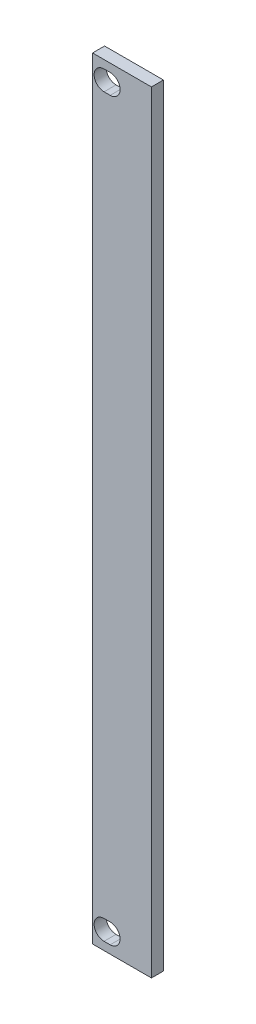
ISO-10303-21;
HEADER;
FILE_DESCRIPTION(('STEP AP214'),'2;1');
FILE_NAME('part.step','',(''),(''),'','','');
FILE_SCHEMA(('AUTOMOTIVE_DESIGN { 1 0 10303 214 1 1 1 1 }'));
ENDSEC;
DATA;
#1=APPLICATION_CONTEXT('core data for automotive mechanical design processes');
#2=APPLICATION_PROTOCOL_DEFINITION('international standard','automotive_design',2000,#1);
#3=PRODUCT_CONTEXT('',#1,'mechanical');
#4=PRODUCT('Part','Part','',(#3));
#5=PRODUCT_RELATED_PRODUCT_CATEGORY('part','',(#4));
#6=PRODUCT_DEFINITION_FORMATION('','',#4);
#7=PRODUCT_DEFINITION_CONTEXT('part definition',#1,'design');
#8=PRODUCT_DEFINITION('design','',#6,#7);
#9=PRODUCT_DEFINITION_SHAPE('','',#8);
#10=(LENGTH_UNIT() NAMED_UNIT(*) SI_UNIT(.MILLI.,.METRE.));
#11=(NAMED_UNIT(*) PLANE_ANGLE_UNIT() SI_UNIT($,.RADIAN.));
#12=(NAMED_UNIT(*) SI_UNIT($,.STERADIAN.) SOLID_ANGLE_UNIT());
#13=UNCERTAINTY_MEASURE_WITH_UNIT(LENGTH_MEASURE(1.E-05),#10,'distance_accuracy_value','');
#14=(GEOMETRIC_REPRESENTATION_CONTEXT(3) GLOBAL_UNCERTAINTY_ASSIGNED_CONTEXT((#13)) GLOBAL_UNIT_ASSIGNED_CONTEXT((#10,
#11,#12)) REPRESENTATION_CONTEXT('',''));
#15=CARTESIAN_POINT('',(0.,0.,0.));
#16=DIRECTION('',(0.,0.,1.));
#17=DIRECTION('',(1.,0.,0.));
#18=AXIS2_PLACEMENT_3D('',#15,#16,#17);
#19=CARTESIAN_POINT('',(0.,0.,2.));
#20=DIRECTION('',(0.,0.,1.));
#21=DIRECTION('',(1.,0.,0.));
#22=AXIS2_PLACEMENT_3D('',#19,#20,#21);
#23=PLANE('',#22);
#24=DIRECTION('',(0.,1.,0.));
#25=VECTOR('',#24,1.);
#26=CARTESIAN_POINT('',(4.9,64.25,2.));
#27=LINE('',#26,#25);
#28=CARTESIAN_POINT('',(4.90000000000001,-64.25,2.));
#29=VERTEX_POINT('',#28);
#30=CARTESIAN_POINT('',(4.9,64.25,2.));
#31=VERTEX_POINT('',#30);
#32=EDGE_CURVE('E238',#29,#31,#27,.T.);
#33=ORIENTED_EDGE('',*,*,#32,.T.);
#34=DIRECTION('',(-1.,0.,0.));
#35=VECTOR('',#34,1.);
#36=CARTESIAN_POINT('',(-4.9,64.25,2.));
#37=LINE('',#36,#35);
#38=CARTESIAN_POINT('',(-4.9,64.25,2.));
#39=VERTEX_POINT('',#38);
#40=EDGE_CURVE('E243',#31,#39,#37,.T.);
#41=ORIENTED_EDGE('',*,*,#40,.T.);
#42=DIRECTION('',(0.,-1.,0.));
#43=VECTOR('',#42,1.);
#44=CARTESIAN_POINT('',(-4.9,64.25,2.));
#45=LINE('',#44,#43);
#46=CARTESIAN_POINT('',(-4.89999999999999,-64.25,2.));
#47=VERTEX_POINT('',#46);
#48=EDGE_CURVE('E251',#39,#47,#45,.T.);
#49=ORIENTED_EDGE('',*,*,#48,.T.);
#50=DIRECTION('',(1.,0.,0.));
#51=VECTOR('',#50,1.);
#52=CARTESIAN_POINT('',(-4.89999999999999,-64.25,2.));
#53=LINE('',#52,#51);
#54=EDGE_CURVE('E254',#47,#29,#53,.T.);
#55=ORIENTED_EDGE('',*,*,#54,.T.);
#56=EDGE_LOOP('',(#33,#41,#49,#55));
#57=FACE_BOUND('',#56,.T.);
#58=DIRECTION('',(1.,0.,0.));
#59=VECTOR('',#58,1.);
#60=CARTESIAN_POINT('',(-2.98799999999998,-62.9,2.));
#61=LINE('',#60,#59);
#62=CARTESIAN_POINT('',(-2.98799999999998,-62.9,2.));
#63=VERTEX_POINT('',#62);
#64=CARTESIAN_POINT('',(-1.97200000000001,-62.9,2.));
#65=VERTEX_POINT('',#64);
#66=EDGE_CURVE('E196',#63,#65,#61,.T.);
#67=ORIENTED_EDGE('',*,*,#66,.F.);
#68=CARTESIAN_POINT('',(-2.98799999999998,-61.25,2.));
#69=DIRECTION('',(0.,0.,1.));
#70=DIRECTION('',(1.,0.,0.));
#71=AXIS2_PLACEMENT_3D('',#68,#69,#70);
#72=CIRCLE('',#71,1.65);
#73=CARTESIAN_POINT('',(-2.98799999999998,-59.6,2.));
#74=VERTEX_POINT('',#73);
#75=EDGE_CURVE('E192',#74,#63,#72,.T.);
#76=ORIENTED_EDGE('',*,*,#75,.F.);
#77=DIRECTION('',(-1.,0.,0.));
#78=VECTOR('',#77,1.);
#79=CARTESIAN_POINT('',(-2.98799999999998,-59.6,2.));
#80=LINE('',#79,#78);
#81=CARTESIAN_POINT('',(-1.97200000000001,-59.6,2.));
#82=VERTEX_POINT('',#81);
#83=EDGE_CURVE('E203',#82,#74,#80,.T.);
#84=ORIENTED_EDGE('',*,*,#83,.F.);
#85=CARTESIAN_POINT('',(-1.97200000000001,-61.25,2.));
#86=DIRECTION('',(0.,0.,1.));
#87=DIRECTION('',(1.,0.,0.));
#88=AXIS2_PLACEMENT_3D('',#85,#86,#87);
#89=CIRCLE('',#88,1.65);
#90=EDGE_CURVE('E208',#65,#82,#89,.T.);
#91=ORIENTED_EDGE('',*,*,#90,.F.);
#92=EDGE_LOOP('',(#67,#76,#84,#91));
#93=FACE_BOUND('',#92,.T.);
#94=DIRECTION('',(1.,0.,0.));
#95=VECTOR('',#94,1.);
#96=CARTESIAN_POINT('',(-2.98800000000001,59.6,2.));
#97=LINE('',#96,#95);
#98=CARTESIAN_POINT('',(-2.98800000000001,59.6,2.));
#99=VERTEX_POINT('',#98);
#100=CARTESIAN_POINT('',(-1.97200000000001,59.6,2.));
#101=VERTEX_POINT('',#100);
#102=EDGE_CURVE('E145',#99,#101,#97,.T.);
#103=ORIENTED_EDGE('',*,*,#102,.F.);
#104=CARTESIAN_POINT('',(-2.98800000000001,61.25,2.));
#105=DIRECTION('',(0.,0.,1.));
#106=DIRECTION('',(1.,0.,0.));
#107=AXIS2_PLACEMENT_3D('',#104,#105,#106);
#108=CIRCLE('',#107,1.65000000000001);
#109=CARTESIAN_POINT('',(-2.98800000000001,62.9,2.));
#110=VERTEX_POINT('',#109);
#111=EDGE_CURVE('E136',#110,#99,#108,.T.);
#112=ORIENTED_EDGE('',*,*,#111,.F.);
#113=DIRECTION('',(-1.,0.,0.));
#114=VECTOR('',#113,1.);
#115=CARTESIAN_POINT('',(-2.98800000000001,62.9,2.));
#116=LINE('',#115,#114);
#117=CARTESIAN_POINT('',(-1.97200000000001,62.9,2.));
#118=VERTEX_POINT('',#117);
#119=EDGE_CURVE('E162',#118,#110,#116,.T.);
#120=ORIENTED_EDGE('',*,*,#119,.F.);
#121=CARTESIAN_POINT('',(-1.97200000000001,61.25,2.));
#122=DIRECTION('',(0.,0.,1.));
#123=DIRECTION('',(1.,0.,0.));
#124=AXIS2_PLACEMENT_3D('',#121,#122,#123);
#125=CIRCLE('',#124,1.65000000000001);
#126=EDGE_CURVE('E158',#101,#118,#125,.T.);
#127=ORIENTED_EDGE('',*,*,#126,.F.);
#128=EDGE_LOOP('',(#103,#112,#120,#127));
#129=FACE_BOUND('',#128,.T.);
#130=ADVANCED_FACE('F46',(#57,#93,#129),#23,.T.);
#131=CARTESIAN_POINT('',(0.,0.,0.));
#132=DIRECTION('',(0.,0.,1.));
#133=DIRECTION('',(1.,0.,0.));
#134=AXIS2_PLACEMENT_3D('',#131,#132,#133);
#135=PLANE('',#134);
#136=CARTESIAN_POINT('',(-2.98799999999998,-61.25,0.));
#137=DIRECTION('',(0.,0.,1.));
#138=DIRECTION('',(1.,0.,0.));
#139=AXIS2_PLACEMENT_3D('',#136,#137,#138);
#140=CIRCLE('',#139,1.65);
#141=CARTESIAN_POINT('',(-2.98799999999998,-59.6,0.));
#142=VERTEX_POINT('',#141);
#143=CARTESIAN_POINT('',(-2.98799999999998,-62.9,0.));
#144=VERTEX_POINT('',#143);
#145=EDGE_CURVE('E154',#142,#144,#140,.T.);
#146=ORIENTED_EDGE('',*,*,#145,.T.);
#147=DIRECTION('',(1.,0.,0.));
#148=VECTOR('',#147,1.);
#149=CARTESIAN_POINT('',(-2.98799999999998,-62.9,0.));
#150=LINE('',#149,#148);
#151=CARTESIAN_POINT('',(-1.97200000000001,-62.9,0.));
#152=VERTEX_POINT('',#151);
#153=EDGE_CURVE('E213',#144,#152,#150,.T.);
#154=ORIENTED_EDGE('',*,*,#153,.T.);
#155=CARTESIAN_POINT('',(-1.97200000000001,-61.25,0.));
#156=DIRECTION('',(0.,0.,1.));
#157=DIRECTION('',(1.,0.,0.));
#158=AXIS2_PLACEMENT_3D('',#155,#156,#157);
#159=CIRCLE('',#158,1.65);
#160=CARTESIAN_POINT('',(-1.97200000000001,-59.6,0.));
#161=VERTEX_POINT('',#160);
#162=EDGE_CURVE('E217',#152,#161,#159,.T.);
#163=ORIENTED_EDGE('',*,*,#162,.T.);
#164=DIRECTION('',(-1.,0.,0.));
#165=VECTOR('',#164,1.);
#166=CARTESIAN_POINT('',(-2.98799999999998,-59.6,0.));
#167=LINE('',#166,#165);
#168=EDGE_CURVE('E197',#161,#142,#167,.T.);
#169=ORIENTED_EDGE('',*,*,#168,.T.);
#170=EDGE_LOOP('',(#146,#154,#163,#169));
#171=FACE_BOUND('',#170,.T.);
#172=DIRECTION('',(0.,1.,0.));
#173=VECTOR('',#172,1.);
#174=CARTESIAN_POINT('',(4.9,64.25,0.));
#175=LINE('',#174,#173);
#176=CARTESIAN_POINT('',(4.90000000000001,-64.25,0.));
#177=VERTEX_POINT('',#176);
#178=CARTESIAN_POINT('',(4.9,64.25,0.));
#179=VERTEX_POINT('',#178);
#180=EDGE_CURVE('E237',#177,#179,#175,.T.);
#181=ORIENTED_EDGE('',*,*,#180,.F.);
#182=DIRECTION('',(1.,0.,0.));
#183=VECTOR('',#182,1.);
#184=CARTESIAN_POINT('',(-4.89999999999999,-64.25,0.));
#185=LINE('',#184,#183);
#186=CARTESIAN_POINT('',(-4.89999999999999,-64.25,0.));
#187=VERTEX_POINT('',#186);
#188=EDGE_CURVE('E244',#187,#177,#185,.T.);
#189=ORIENTED_EDGE('',*,*,#188,.F.);
#190=DIRECTION('',(0.,-1.,0.));
#191=VECTOR('',#190,1.);
#192=CARTESIAN_POINT('',(-4.9,64.25,0.));
#193=LINE('',#192,#191);
#194=CARTESIAN_POINT('',(-4.9,64.25,0.));
#195=VERTEX_POINT('',#194);
#196=EDGE_CURVE('E265',#195,#187,#193,.T.);
#197=ORIENTED_EDGE('',*,*,#196,.F.);
#198=DIRECTION('',(-1.,0.,0.));
#199=VECTOR('',#198,1.);
#200=CARTESIAN_POINT('',(-4.9,64.25,0.));
#201=LINE('',#200,#199);
#202=EDGE_CURVE('E262',#179,#195,#201,.T.);
#203=ORIENTED_EDGE('',*,*,#202,.F.);
#204=EDGE_LOOP('',(#181,#189,#197,#203));
#205=FACE_BOUND('',#204,.T.);
#206=CARTESIAN_POINT('',(-2.98800000000001,61.25,0.));
#207=DIRECTION('',(0.,0.,1.));
#208=DIRECTION('',(1.,0.,0.));
#209=AXIS2_PLACEMENT_3D('',#206,#207,#208);
#210=CIRCLE('',#209,1.65000000000001);
#211=CARTESIAN_POINT('',(-2.98800000000001,62.9,0.));
#212=VERTEX_POINT('',#211);
#213=CARTESIAN_POINT('',(-2.98800000000001,59.6,0.));
#214=VERTEX_POINT('',#213);
#215=EDGE_CURVE('E70',#212,#214,#210,.T.);
#216=ORIENTED_EDGE('',*,*,#215,.T.);
#217=DIRECTION('',(1.,0.,0.));
#218=VECTOR('',#217,1.);
#219=CARTESIAN_POINT('',(-2.98800000000001,59.6,0.));
#220=LINE('',#219,#218);
#221=CARTESIAN_POINT('',(-1.97200000000001,59.6,0.));
#222=VERTEX_POINT('',#221);
#223=EDGE_CURVE('E152',#214,#222,#220,.T.);
#224=ORIENTED_EDGE('',*,*,#223,.T.);
#225=CARTESIAN_POINT('',(-1.97200000000001,61.25,0.));
#226=DIRECTION('',(0.,0.,1.));
#227=DIRECTION('',(1.,0.,0.));
#228=AXIS2_PLACEMENT_3D('',#225,#226,#227);
#229=CIRCLE('',#228,1.65000000000001);
#230=CARTESIAN_POINT('',(-1.97200000000001,62.9,0.));
#231=VERTEX_POINT('',#230);
#232=EDGE_CURVE('E179',#222,#231,#229,.T.);
#233=ORIENTED_EDGE('',*,*,#232,.T.);
#234=DIRECTION('',(-1.,0.,0.));
#235=VECTOR('',#234,1.);
#236=CARTESIAN_POINT('',(-2.98800000000001,62.9,0.));
#237=LINE('',#236,#235);
#238=EDGE_CURVE('E146',#231,#212,#237,.T.);
#239=ORIENTED_EDGE('',*,*,#238,.T.);
#240=EDGE_LOOP('',(#216,#224,#233,#239));
#241=FACE_BOUND('',#240,.T.);
#242=ADVANCED_FACE('F288',(#171,#205,#241),#135,.F.);
#243=CARTESIAN_POINT('',(4.9,64.25,2.));
#244=DIRECTION('',(-1.,0.,0.));
#245=DIRECTION('',(0.,-1.,0.));
#246=AXIS2_PLACEMENT_3D('',#243,#244,#245);
#247=PLANE('',#246);
#248=ORIENTED_EDGE('',*,*,#180,.T.);
#249=DIRECTION('',(0.,0.,-1.));
#250=VECTOR('',#249,1.);
#251=CARTESIAN_POINT('',(4.9,64.25,2.));
#252=LINE('',#251,#250);
#253=EDGE_CURVE('E12',#31,#179,#252,.T.);
#254=ORIENTED_EDGE('',*,*,#253,.F.);
#255=ORIENTED_EDGE('',*,*,#32,.F.);
#256=DIRECTION('',(0.,0.,-1.));
#257=VECTOR('',#256,1.);
#258=CARTESIAN_POINT('',(4.90000000000001,-64.25,2.));
#259=LINE('',#258,#257);
#260=EDGE_CURVE('E258',#29,#177,#259,.T.);
#261=ORIENTED_EDGE('',*,*,#260,.T.);
#262=EDGE_LOOP('',(#248,#254,#255,#261));
#263=FACE_BOUND('',#262,.T.);
#264=ADVANCED_FACE('F48',(#263),#247,.F.);
#265=CARTESIAN_POINT('',(-4.9,64.25,2.));
#266=DIRECTION('',(0.,-1.,0.));
#267=DIRECTION('',(0.,0.,-1.));
#268=AXIS2_PLACEMENT_3D('',#265,#266,#267);
#269=PLANE('',#268);
#270=ORIENTED_EDGE('',*,*,#202,.T.);
#271=DIRECTION('',(0.,0.,-1.));
#272=VECTOR('',#271,1.);
#273=CARTESIAN_POINT('',(-4.9,64.25,2.));
#274=LINE('',#273,#272);
#275=EDGE_CURVE('E55',#39,#195,#274,.T.);
#276=ORIENTED_EDGE('',*,*,#275,.F.);
#277=ORIENTED_EDGE('',*,*,#40,.F.);
#278=ORIENTED_EDGE('',*,*,#253,.T.);
#279=EDGE_LOOP('',(#270,#276,#277,#278));
#280=FACE_BOUND('',#279,.T.);
#281=ADVANCED_FACE('F327',(#280),#269,.F.);
#282=CARTESIAN_POINT('',(-4.9,64.25,2.));
#283=DIRECTION('',(1.,0.,0.));
#284=DIRECTION('',(0.,1.,0.));
#285=AXIS2_PLACEMENT_3D('',#282,#283,#284);
#286=PLANE('',#285);
#287=ORIENTED_EDGE('',*,*,#196,.T.);
#288=DIRECTION('',(0.,0.,-1.));
#289=VECTOR('',#288,1.);
#290=CARTESIAN_POINT('',(-4.89999999999999,-64.25,2.));
#291=LINE('',#290,#289);
#292=EDGE_CURVE('E273',#47,#187,#291,.T.);
#293=ORIENTED_EDGE('',*,*,#292,.F.);
#294=ORIENTED_EDGE('',*,*,#48,.F.);
#295=ORIENTED_EDGE('',*,*,#275,.T.);
#296=EDGE_LOOP('',(#287,#293,#294,#295));
#297=FACE_BOUND('',#296,.T.);
#298=ADVANCED_FACE('F282',(#297),#286,.F.);
#299=CARTESIAN_POINT('',(-4.89999999999999,-64.25,2.));
#300=DIRECTION('',(0.,1.,0.));
#301=DIRECTION('',(0.,0.,1.));
#302=AXIS2_PLACEMENT_3D('',#299,#300,#301);
#303=PLANE('',#302);
#304=ORIENTED_EDGE('',*,*,#188,.T.);
#305=ORIENTED_EDGE('',*,*,#260,.F.);
#306=ORIENTED_EDGE('',*,*,#54,.F.);
#307=ORIENTED_EDGE('',*,*,#292,.T.);
#308=EDGE_LOOP('',(#304,#305,#306,#307));
#309=FACE_BOUND('',#308,.T.);
#310=ADVANCED_FACE('F292',(#309),#303,.F.);
#311=CARTESIAN_POINT('',(-2.98799999999998,-61.25,2.));
#312=DIRECTION('',(0.,0.,-1.));
#313=DIRECTION('',(-1.,0.,0.));
#314=AXIS2_PLACEMENT_3D('',#311,#312,#313);
#315=CYLINDRICAL_SURFACE('',#314,1.65);
#316=ORIENTED_EDGE('',*,*,#145,.F.);
#317=DIRECTION('',(0.,0.,-1.));
#318=VECTOR('',#317,1.);
#319=CARTESIAN_POINT('',(-2.98799999999998,-59.6,2.));
#320=LINE('',#319,#318);
#321=EDGE_CURVE('E207',#74,#142,#320,.T.);
#322=ORIENTED_EDGE('',*,*,#321,.F.);
#323=ORIENTED_EDGE('',*,*,#75,.T.);
#324=DIRECTION('',(0.,0.,-1.));
#325=VECTOR('',#324,1.);
#326=CARTESIAN_POINT('',(-2.98799999999998,-62.9,2.));
#327=LINE('',#326,#325);
#328=EDGE_CURVE('E233',#63,#144,#327,.T.);
#329=ORIENTED_EDGE('',*,*,#328,.T.);
#330=EDGE_LOOP('',(#316,#322,#323,#329));
#331=FACE_BOUND('',#330,.T.);
#332=ADVANCED_FACE('F319',(#331),#315,.F.);
#333=CARTESIAN_POINT('',(-2.98799999999998,-62.9,2.));
#334=DIRECTION('',(0.,1.,0.));
#335=DIRECTION('',(0.,0.,1.));
#336=AXIS2_PLACEMENT_3D('',#333,#334,#335);
#337=PLANE('',#336);
#338=ORIENTED_EDGE('',*,*,#153,.F.);
#339=ORIENTED_EDGE('',*,*,#328,.F.);
#340=ORIENTED_EDGE('',*,*,#66,.T.);
#341=DIRECTION('',(0.,0.,-1.));
#342=VECTOR('',#341,1.);
#343=CARTESIAN_POINT('',(-1.97200000000001,-62.9,2.));
#344=LINE('',#343,#342);
#345=EDGE_CURVE('E230',#65,#152,#344,.T.);
#346=ORIENTED_EDGE('',*,*,#345,.T.);
#347=EDGE_LOOP('',(#338,#339,#340,#346));
#348=FACE_BOUND('',#347,.T.);
#349=ADVANCED_FACE('F307',(#348),#337,.T.);
#350=CARTESIAN_POINT('',(-1.97200000000001,-61.25,2.));
#351=DIRECTION('',(0.,0.,-1.));
#352=DIRECTION('',(-1.,0.,0.));
#353=AXIS2_PLACEMENT_3D('',#350,#351,#352);
#354=CYLINDRICAL_SURFACE('',#353,1.65);
#355=ORIENTED_EDGE('',*,*,#162,.F.);
#356=ORIENTED_EDGE('',*,*,#345,.F.);
#357=ORIENTED_EDGE('',*,*,#90,.T.);
#358=DIRECTION('',(0.,0.,-1.));
#359=VECTOR('',#358,1.);
#360=CARTESIAN_POINT('',(-1.97200000000001,-59.6,2.));
#361=LINE('',#360,#359);
#362=EDGE_CURVE('E227',#82,#161,#361,.T.);
#363=ORIENTED_EDGE('',*,*,#362,.T.);
#364=EDGE_LOOP('',(#355,#356,#357,#363));
#365=FACE_BOUND('',#364,.T.);
#366=ADVANCED_FACE('F312',(#365),#354,.F.);
#367=CARTESIAN_POINT('',(-2.98799999999998,-59.6,2.));
#368=DIRECTION('',(0.,-1.,0.));
#369=DIRECTION('',(0.,0.,-1.));
#370=AXIS2_PLACEMENT_3D('',#367,#368,#369);
#371=PLANE('',#370);
#372=ORIENTED_EDGE('',*,*,#168,.F.);
#373=ORIENTED_EDGE('',*,*,#362,.F.);
#374=ORIENTED_EDGE('',*,*,#83,.T.);
#375=ORIENTED_EDGE('',*,*,#321,.T.);
#376=EDGE_LOOP('',(#372,#373,#374,#375));
#377=FACE_BOUND('',#376,.T.);
#378=ADVANCED_FACE('F317',(#377),#371,.T.);
#379=CARTESIAN_POINT('',(-2.98800000000001,61.25,2.));
#380=DIRECTION('',(0.,0.,-1.));
#381=DIRECTION('',(-1.,0.,0.));
#382=AXIS2_PLACEMENT_3D('',#379,#380,#381);
#383=CYLINDRICAL_SURFACE('',#382,1.65000000000001);
#384=ORIENTED_EDGE('',*,*,#215,.F.);
#385=DIRECTION('',(0.,0.,-1.));
#386=VECTOR('',#385,1.);
#387=CARTESIAN_POINT('',(-2.98800000000001,62.9,2.));
#388=LINE('',#387,#386);
#389=EDGE_CURVE('E140',#110,#212,#388,.T.);
#390=ORIENTED_EDGE('',*,*,#389,.F.);
#391=ORIENTED_EDGE('',*,*,#111,.T.);
#392=DIRECTION('',(0.,0.,-1.));
#393=VECTOR('',#392,1.);
#394=CARTESIAN_POINT('',(-2.98800000000001,59.6,2.));
#395=LINE('',#394,#393);
#396=EDGE_CURVE('E139',#99,#214,#395,.T.);
#397=ORIENTED_EDGE('',*,*,#396,.T.);
#398=EDGE_LOOP('',(#384,#390,#391,#397));
#399=FACE_BOUND('',#398,.T.);
#400=ADVANCED_FACE('F138',(#399),#383,.F.);
#401=CARTESIAN_POINT('',(-2.98800000000001,59.6,2.));
#402=DIRECTION('',(0.,1.,0.));
#403=DIRECTION('',(0.,0.,1.));
#404=AXIS2_PLACEMENT_3D('',#401,#402,#403);
#405=PLANE('',#404);
#406=ORIENTED_EDGE('',*,*,#223,.F.);
#407=ORIENTED_EDGE('',*,*,#396,.F.);
#408=ORIENTED_EDGE('',*,*,#102,.T.);
#409=DIRECTION('',(0.,0.,-1.));
#410=VECTOR('',#409,1.);
#411=CARTESIAN_POINT('',(-1.97200000000001,59.6,2.));
#412=LINE('',#411,#410);
#413=EDGE_CURVE('E155',#101,#222,#412,.T.);
#414=ORIENTED_EDGE('',*,*,#413,.T.);
#415=EDGE_LOOP('',(#406,#407,#408,#414));
#416=FACE_BOUND('',#415,.T.);
#417=ADVANCED_FACE('F149',(#416),#405,.T.);
#418=CARTESIAN_POINT('',(-1.97200000000001,61.25,2.));
#419=DIRECTION('',(0.,0.,-1.));
#420=DIRECTION('',(-1.,0.,0.));
#421=AXIS2_PLACEMENT_3D('',#418,#419,#420);
#422=CYLINDRICAL_SURFACE('',#421,1.65000000000001);
#423=ORIENTED_EDGE('',*,*,#232,.F.);
#424=ORIENTED_EDGE('',*,*,#413,.F.);
#425=ORIENTED_EDGE('',*,*,#126,.T.);
#426=DIRECTION('',(0.,0.,-1.));
#427=VECTOR('',#426,1.);
#428=CARTESIAN_POINT('',(-1.97200000000001,62.9,2.));
#429=LINE('',#428,#427);
#430=EDGE_CURVE('E62',#118,#231,#429,.T.);
#431=ORIENTED_EDGE('',*,*,#430,.T.);
#432=EDGE_LOOP('',(#423,#424,#425,#431));
#433=FACE_BOUND('',#432,.T.);
#434=ADVANCED_FACE('F390',(#433),#422,.F.);
#435=CARTESIAN_POINT('',(-2.98800000000001,62.9,2.));
#436=DIRECTION('',(0.,-1.,0.));
#437=DIRECTION('',(0.,0.,-1.));
#438=AXIS2_PLACEMENT_3D('',#435,#436,#437);
#439=PLANE('',#438);
#440=ORIENTED_EDGE('',*,*,#238,.F.);
#441=ORIENTED_EDGE('',*,*,#430,.F.);
#442=ORIENTED_EDGE('',*,*,#119,.T.);
#443=ORIENTED_EDGE('',*,*,#389,.T.);
#444=EDGE_LOOP('',(#440,#441,#442,#443));
#445=FACE_BOUND('',#444,.T.);
#446=ADVANCED_FACE('F398',(#445),#439,.T.);
#447=CLOSED_SHELL('',(#130,#242,#264,#281,#298,#310,#332,#349,#366,#378,#400,#417,#434,#446));
#448=MANIFOLD_SOLID_BREP('B2',#447);
#449=ADVANCED_BREP_SHAPE_REPRESENTATION('',(#18,#448),#14);
#450=SHAPE_DEFINITION_REPRESENTATION(#9,#449);
ENDSEC;
END-ISO-10303-21;
